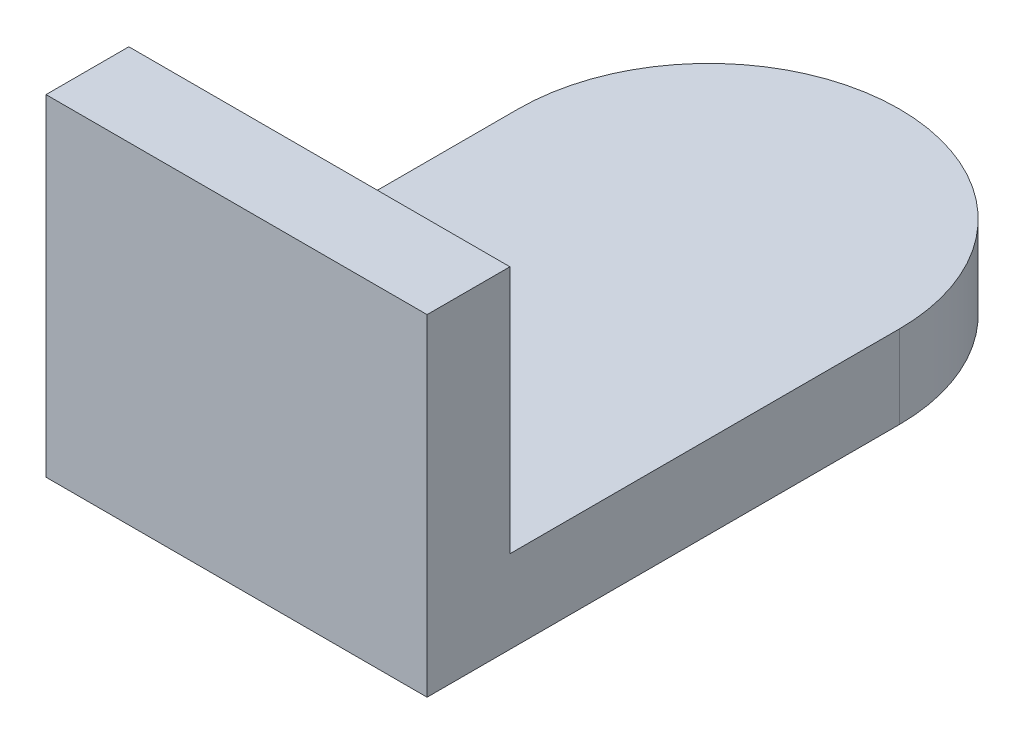
ISO-10303-21;
HEADER;
FILE_DESCRIPTION(('STEP AP214'),'2;1');
FILE_NAME('part.step','',(''),(''),'','','');
FILE_SCHEMA(('AUTOMOTIVE_DESIGN { 1 0 10303 214 1 1 1 1 }'));
ENDSEC;
DATA;
#1=APPLICATION_CONTEXT('core data for automotive mechanical design processes');
#2=APPLICATION_PROTOCOL_DEFINITION('international standard','automotive_design',2000,#1);
#3=PRODUCT_CONTEXT('',#1,'mechanical');
#4=PRODUCT('Part','Part','',(#3));
#5=PRODUCT_RELATED_PRODUCT_CATEGORY('part','',(#4));
#6=PRODUCT_DEFINITION_FORMATION('','',#4);
#7=PRODUCT_DEFINITION_CONTEXT('part definition',#1,'design');
#8=PRODUCT_DEFINITION('design','',#6,#7);
#9=PRODUCT_DEFINITION_SHAPE('','',#8);
#10=(LENGTH_UNIT() NAMED_UNIT(*) SI_UNIT(.MILLI.,.METRE.));
#11=(NAMED_UNIT(*) PLANE_ANGLE_UNIT() SI_UNIT($,.RADIAN.));
#12=(NAMED_UNIT(*) SI_UNIT($,.STERADIAN.) SOLID_ANGLE_UNIT());
#13=UNCERTAINTY_MEASURE_WITH_UNIT(LENGTH_MEASURE(1.E-05),#10,'distance_accuracy_value','');
#14=(GEOMETRIC_REPRESENTATION_CONTEXT(3) GLOBAL_UNCERTAINTY_ASSIGNED_CONTEXT((#13)) GLOBAL_UNIT_ASSIGNED_CONTEXT((#10,
#11,#12)) REPRESENTATION_CONTEXT('',''));
#15=CARTESIAN_POINT('',(0.,0.,0.));
#16=DIRECTION('',(0.,0.,1.));
#17=DIRECTION('',(1.,0.,0.));
#18=AXIS2_PLACEMENT_3D('',#15,#16,#17);
#19=CARTESIAN_POINT('',(0.,0.,1.45));
#20=DIRECTION('',(0.,0.,-1.));
#21=DIRECTION('',(-1.,0.,0.));
#22=AXIS2_PLACEMENT_3D('',#19,#20,#21);
#23=PLANE('',#22);
#24=DIRECTION('',(0.,1.,0.));
#25=VECTOR('',#24,1.);
#26=CARTESIAN_POINT('',(0.865,-0.2,1.45));
#27=LINE('',#26,#25);
#28=CARTESIAN_POINT('',(0.865,-0.35,1.45));
#29=VERTEX_POINT('',#28);
#30=CARTESIAN_POINT('',(0.865,-0.2,1.45));
#31=VERTEX_POINT('',#30);
#32=EDGE_CURVE('E11',#29,#31,#27,.T.);
#33=ORIENTED_EDGE('',*,*,#32,.F.);
#34=DIRECTION('',(-1.,0.,0.));
#35=VECTOR('',#34,1.);
#36=CARTESIAN_POINT('',(0.635,-0.35,1.45));
#37=LINE('',#36,#35);
#38=CARTESIAN_POINT('',(0.635,-0.35,1.45));
#39=VERTEX_POINT('',#38);
#40=EDGE_CURVE('E24',#29,#39,#37,.T.);
#41=ORIENTED_EDGE('',*,*,#40,.T.);
#42=DIRECTION('',(0.,-1.,0.));
#43=VECTOR('',#42,1.);
#44=CARTESIAN_POINT('',(0.635,-0.2,1.45));
#45=LINE('',#44,#43);
#46=CARTESIAN_POINT('',(0.635,-0.2,1.45));
#47=VERTEX_POINT('',#46);
#48=EDGE_CURVE('E74',#47,#39,#45,.T.);
#49=ORIENTED_EDGE('',*,*,#48,.F.);
#50=DIRECTION('',(-1.,0.,0.));
#51=VECTOR('',#50,1.);
#52=CARTESIAN_POINT('',(0.635,-0.2,1.45));
#53=LINE('',#52,#51);
#54=EDGE_CURVE('E117',#31,#47,#53,.T.);
#55=ORIENTED_EDGE('',*,*,#54,.F.);
#56=EDGE_LOOP('',(#33,#41,#49,#55));
#57=FACE_BOUND('',#56,.T.);
#58=ADVANCED_FACE('F17',(#57),#23,.T.);
#59=CARTESIAN_POINT('',(0.635,-0.2,1.45));
#60=DIRECTION('',(0.,1.,0.));
#61=DIRECTION('',(-1.,0.,0.));
#62=AXIS2_PLACEMENT_3D('',#59,#60,#61);
#63=PLANE('',#62);
#64=DIRECTION('',(-1.,0.,0.));
#65=VECTOR('',#64,1.);
#66=CARTESIAN_POINT('',(0.635,-0.2,1.5));
#67=LINE('',#66,#65);
#68=CARTESIAN_POINT('',(0.865,-0.2,1.5));
#69=VERTEX_POINT('',#68);
#70=CARTESIAN_POINT('',(0.635,-0.2,1.5));
#71=VERTEX_POINT('',#70);
#72=EDGE_CURVE('E115',#69,#71,#67,.T.);
#73=ORIENTED_EDGE('',*,*,#72,.F.);
#74=DIRECTION('',(0.,0.,1.));
#75=VECTOR('',#74,1.);
#76=CARTESIAN_POINT('',(0.865,-0.2,1.45));
#77=LINE('',#76,#75);
#78=EDGE_CURVE('E113',#31,#69,#77,.T.);
#79=ORIENTED_EDGE('',*,*,#78,.F.);
#80=ORIENTED_EDGE('',*,*,#54,.T.);
#81=DIRECTION('',(0.,0.,1.));
#82=VECTOR('',#81,1.);
#83=CARTESIAN_POINT('',(0.635,-0.2,1.45));
#84=LINE('',#83,#82);
#85=EDGE_CURVE('E110',#47,#71,#84,.T.);
#86=ORIENTED_EDGE('',*,*,#85,.T.);
#87=EDGE_LOOP('',(#73,#79,#80,#86));
#88=FACE_BOUND('',#87,.T.);
#89=ADVANCED_FACE('F127',(#88),#63,.T.);
#90=CARTESIAN_POINT('',(0.865,-0.2,1.45));
#91=DIRECTION('',(1.,0.,0.));
#92=DIRECTION('',(0.,0.,-1.));
#93=AXIS2_PLACEMENT_3D('',#90,#91,#92);
#94=PLANE('',#93);
#95=DIRECTION('',(0.,1.,0.));
#96=VECTOR('',#95,1.);
#97=CARTESIAN_POINT('',(0.865,-0.2,1.5));
#98=LINE('',#97,#96);
#99=CARTESIAN_POINT('',(0.865,-0.4,1.5));
#100=VERTEX_POINT('',#99);
#101=EDGE_CURVE('E107',#100,#69,#98,.T.);
#102=ORIENTED_EDGE('',*,*,#101,.F.);
#103=DIRECTION('',(0.,0.,1.));
#104=VECTOR('',#103,1.);
#105=CARTESIAN_POINT('',(0.865,-0.4,1.45));
#106=LINE('',#105,#104);
#107=CARTESIAN_POINT('',(0.865,-0.4,1.215));
#108=VERTEX_POINT('',#107);
#109=EDGE_CURVE('E104',#108,#100,#106,.T.);
#110=ORIENTED_EDGE('',*,*,#109,.F.);
#111=DIRECTION('',(0.,-1.,0.));
#112=VECTOR('',#111,1.);
#113=CARTESIAN_POINT('',(0.865,-0.35,1.215));
#114=LINE('',#113,#112);
#115=CARTESIAN_POINT('',(0.865,-0.35,1.215));
#116=VERTEX_POINT('',#115);
#117=EDGE_CURVE('E102',#116,#108,#114,.T.);
#118=ORIENTED_EDGE('',*,*,#117,.F.);
#119=DIRECTION('',(0.,0.,1.));
#120=VECTOR('',#119,1.);
#121=CARTESIAN_POINT('',(0.865,-0.35,1.45));
#122=LINE('',#121,#120);
#123=EDGE_CURVE('E90',#116,#29,#122,.T.);
#124=ORIENTED_EDGE('',*,*,#123,.T.);
#125=ORIENTED_EDGE('',*,*,#32,.T.);
#126=ORIENTED_EDGE('',*,*,#78,.T.);
#127=EDGE_LOOP('',(#102,#110,#118,#124,#125,#126));
#128=FACE_BOUND('',#127,.T.);
#129=ADVANCED_FACE('F120',(#128),#94,.T.);
#130=CARTESIAN_POINT('',(0.635,-0.4,1.45));
#131=DIRECTION('',(0.,-1.,0.));
#132=DIRECTION('',(1.,0.,0.));
#133=AXIS2_PLACEMENT_3D('',#130,#131,#132);
#134=PLANE('',#133);
#135=DIRECTION('',(1.,0.,0.));
#136=VECTOR('',#135,1.);
#137=CARTESIAN_POINT('',(0.635,-0.4,1.5));
#138=LINE('',#137,#136);
#139=CARTESIAN_POINT('',(0.635,-0.4,1.5));
#140=VERTEX_POINT('',#139);
#141=EDGE_CURVE('E98',#140,#100,#138,.T.);
#142=ORIENTED_EDGE('',*,*,#141,.F.);
#143=DIRECTION('',(0.,0.,1.));
#144=VECTOR('',#143,1.);
#145=CARTESIAN_POINT('',(0.635,-0.4,1.45));
#146=LINE('',#145,#144);
#147=CARTESIAN_POINT('',(0.635,-0.4,1.215));
#148=VERTEX_POINT('',#147);
#149=EDGE_CURVE('E96',#148,#140,#146,.T.);
#150=ORIENTED_EDGE('',*,*,#149,.F.);
#151=CARTESIAN_POINT('',(0.75,-0.4,1.215));
#152=DIRECTION('',(0.,-1.,0.));
#153=DIRECTION('',(1.,0.,0.));
#154=AXIS2_PLACEMENT_3D('',#151,#152,#153);
#155=CIRCLE('',#154,0.115);
#156=EDGE_CURVE('E86',#148,#108,#155,.T.);
#157=ORIENTED_EDGE('',*,*,#156,.T.);
#158=ORIENTED_EDGE('',*,*,#109,.T.);
#159=EDGE_LOOP('',(#142,#150,#157,#158));
#160=FACE_BOUND('',#159,.T.);
#161=ADVANCED_FACE('F122',(#160),#134,.T.);
#162=CARTESIAN_POINT('',(0.635,-0.2,1.45));
#163=DIRECTION('',(-1.,0.,0.));
#164=DIRECTION('',(0.,0.,1.));
#165=AXIS2_PLACEMENT_3D('',#162,#163,#164);
#166=PLANE('',#165);
#167=DIRECTION('',(0.,-1.,0.));
#168=VECTOR('',#167,1.);
#169=CARTESIAN_POINT('',(0.635,-0.2,1.5));
#170=LINE('',#169,#168);
#171=EDGE_CURVE('E77',#71,#140,#170,.T.);
#172=ORIENTED_EDGE('',*,*,#171,.F.);
#173=ORIENTED_EDGE('',*,*,#85,.F.);
#174=ORIENTED_EDGE('',*,*,#48,.T.);
#175=DIRECTION('',(0.,0.,-1.));
#176=VECTOR('',#175,1.);
#177=CARTESIAN_POINT('',(0.635,-0.35,1.45));
#178=LINE('',#177,#176);
#179=CARTESIAN_POINT('',(0.635,-0.35,1.215));
#180=VERTEX_POINT('',#179);
#181=EDGE_CURVE('E67',#39,#180,#178,.T.);
#182=ORIENTED_EDGE('',*,*,#181,.T.);
#183=DIRECTION('',(0.,-1.,0.));
#184=VECTOR('',#183,1.);
#185=CARTESIAN_POINT('',(0.635,-0.35,1.215));
#186=LINE('',#185,#184);
#187=EDGE_CURVE('E72',#180,#148,#186,.T.);
#188=ORIENTED_EDGE('',*,*,#187,.T.);
#189=ORIENTED_EDGE('',*,*,#149,.T.);
#190=EDGE_LOOP('',(#172,#173,#174,#182,#188,#189));
#191=FACE_BOUND('',#190,.T.);
#192=ADVANCED_FACE('F70',(#191),#166,.T.);
#193=CARTESIAN_POINT('',(0.,0.,1.5));
#194=DIRECTION('',(0.,0.,-1.));
#195=DIRECTION('',(-1.,0.,0.));
#196=AXIS2_PLACEMENT_3D('',#193,#194,#195);
#197=PLANE('',#196);
#198=ORIENTED_EDGE('',*,*,#72,.T.);
#199=ORIENTED_EDGE('',*,*,#171,.T.);
#200=ORIENTED_EDGE('',*,*,#141,.T.);
#201=ORIENTED_EDGE('',*,*,#101,.T.);
#202=EDGE_LOOP('',(#198,#199,#200,#201));
#203=FACE_BOUND('',#202,.T.);
#204=ADVANCED_FACE('F124',(#203),#197,.F.);
#205=CARTESIAN_POINT('',(0.75,-0.35,1.215));
#206=DIRECTION('',(0.,-1.,0.));
#207=DIRECTION('',(1.,0.,0.));
#208=AXIS2_PLACEMENT_3D('',#205,#206,#207);
#209=CYLINDRICAL_SURFACE('',#208,0.115);
#210=ORIENTED_EDGE('',*,*,#156,.F.);
#211=ORIENTED_EDGE('',*,*,#187,.F.);
#212=CARTESIAN_POINT('',(0.75,-0.35,1.215));
#213=DIRECTION('',(0.,-1.,0.));
#214=DIRECTION('',(1.,0.,0.));
#215=AXIS2_PLACEMENT_3D('',#212,#213,#214);
#216=CIRCLE('',#215,0.115);
#217=EDGE_CURVE('E84',#180,#116,#216,.T.);
#218=ORIENTED_EDGE('',*,*,#217,.T.);
#219=ORIENTED_EDGE('',*,*,#117,.T.);
#220=EDGE_LOOP('',(#210,#211,#218,#219));
#221=FACE_BOUND('',#220,.T.);
#222=ADVANCED_FACE('F82',(#221),#209,.T.);
#223=CARTESIAN_POINT('',(0.75,-0.35,1.215));
#224=DIRECTION('',(0.,-1.,0.));
#225=DIRECTION('',(1.,0.,0.));
#226=AXIS2_PLACEMENT_3D('',#223,#224,#225);
#227=PLANE('',#226);
#228=ORIENTED_EDGE('',*,*,#181,.F.);
#229=ORIENTED_EDGE('',*,*,#40,.F.);
#230=ORIENTED_EDGE('',*,*,#123,.F.);
#231=ORIENTED_EDGE('',*,*,#217,.F.);
#232=EDGE_LOOP('',(#228,#229,#230,#231));
#233=FACE_BOUND('',#232,.T.);
#234=ADVANCED_FACE('F89',(#233),#227,.F.);
#235=CLOSED_SHELL('',(#58,#89,#129,#161,#192,#204,#222,#234));
#236=MANIFOLD_SOLID_BREP('B1',#235);
#237=ADVANCED_BREP_SHAPE_REPRESENTATION('',(#18,#236),#14);
#238=SHAPE_DEFINITION_REPRESENTATION(#9,#237);
ENDSEC;
END-ISO-10303-21;
